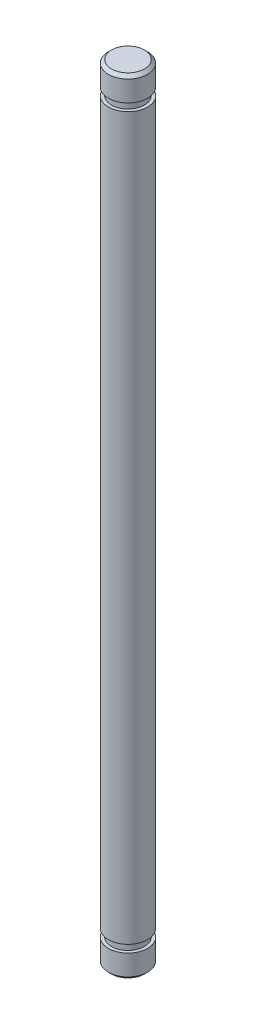
ISO-10303-21;
HEADER;
FILE_DESCRIPTION(('STEP AP214'),'2;1');
FILE_NAME('part.step','',(''),(''),'','','');
FILE_SCHEMA(('AUTOMOTIVE_DESIGN { 1 0 10303 214 1 1 1 1 }'));
ENDSEC;
DATA;
#1=APPLICATION_CONTEXT('core data for automotive mechanical design processes');
#2=APPLICATION_PROTOCOL_DEFINITION('international standard','automotive_design',2000,#1);
#3=PRODUCT_CONTEXT('',#1,'mechanical');
#4=PRODUCT('Part','Part','',(#3));
#5=PRODUCT_RELATED_PRODUCT_CATEGORY('part','',(#4));
#6=PRODUCT_DEFINITION_FORMATION('','',#4);
#7=PRODUCT_DEFINITION_CONTEXT('part definition',#1,'design');
#8=PRODUCT_DEFINITION('design','',#6,#7);
#9=PRODUCT_DEFINITION_SHAPE('','',#8);
#10=(LENGTH_UNIT() NAMED_UNIT(*) SI_UNIT(.MILLI.,.METRE.));
#11=(NAMED_UNIT(*) PLANE_ANGLE_UNIT() SI_UNIT($,.RADIAN.));
#12=(NAMED_UNIT(*) SI_UNIT($,.STERADIAN.) SOLID_ANGLE_UNIT());
#13=UNCERTAINTY_MEASURE_WITH_UNIT(LENGTH_MEASURE(1.E-05),#10,'distance_accuracy_value','');
#14=(GEOMETRIC_REPRESENTATION_CONTEXT(3) GLOBAL_UNCERTAINTY_ASSIGNED_CONTEXT((#13)) GLOBAL_UNIT_ASSIGNED_CONTEXT((#10,
#11,#12)) REPRESENTATION_CONTEXT('',''));
#15=CARTESIAN_POINT('',(0.,0.,0.));
#16=DIRECTION('',(0.,0.,1.));
#17=DIRECTION('',(1.,0.,0.));
#18=AXIS2_PLACEMENT_3D('',#15,#16,#17);
#19=CARTESIAN_POINT('',(0.,15.875,0.));
#20=DIRECTION('',(0.,-1.,0.));
#21=DIRECTION('',(0.,0.,-1.));
#22=AXIS2_PLACEMENT_3D('',#19,#20,#21);
#23=CYLINDRICAL_SURFACE('',#22,0.79375);
#24=CARTESIAN_POINT('',(0.,14.605,0.));
#25=DIRECTION('',(0.,1.,0.));
#26=DIRECTION('',(0.,0.,1.));
#27=AXIS2_PLACEMENT_3D('',#24,#25,#26);
#28=CIRCLE('',#27,0.79375);
#29=CARTESIAN_POINT('',(0.,14.605,0.79375));
#30=VERTEX_POINT('',#29);
#31=EDGE_CURVE('E399',#30,#30,#28,.T.);
#32=ORIENTED_EDGE('',*,*,#31,.F.);
#33=EDGE_LOOP('',(#32));
#34=FACE_BOUND('',#33,.T.);
#35=CARTESIAN_POINT('',(0.,-14.605,0.));
#36=DIRECTION('',(0.,1.,0.));
#37=DIRECTION('',(0.,0.,1.));
#38=AXIS2_PLACEMENT_3D('',#35,#36,#37);
#39=CIRCLE('',#38,0.79375);
#40=CARTESIAN_POINT('',(0.,-14.605,0.79375));
#41=VERTEX_POINT('',#40);
#42=EDGE_CURVE('E402',#41,#41,#39,.T.);
#43=ORIENTED_EDGE('',*,*,#42,.T.);
#44=EDGE_LOOP('',(#43));
#45=FACE_BOUND('',#44,.T.);
#46=ADVANCED_FACE('F370',(#34,#45),#23,.T.);
#47=CARTESIAN_POINT('',(0.,15.748,0.));
#48=DIRECTION('',(0.,1.,0.));
#49=DIRECTION('',(0.,0.,1.));
#50=AXIS2_PLACEMENT_3D('',#47,#48,#49);
#51=CIRCLE('',#50,0.79375);
#52=CARTESIAN_POINT('',(0.,15.748,0.79375));
#53=VERTEX_POINT('',#52);
#54=EDGE_CURVE('E10',#53,#53,#51,.F.);
#55=ORIENTED_EDGE('',*,*,#54,.T.);
#56=EDGE_LOOP('',(#55));
#57=FACE_BOUND('',#56,.T.);
#58=CARTESIAN_POINT('',(0.,14.9098,0.));
#59=DIRECTION('',(0.,1.,0.));
#60=DIRECTION('',(0.,0.,1.));
#61=AXIS2_PLACEMENT_3D('',#58,#59,#60);
#62=CIRCLE('',#61,0.79375);
#63=CARTESIAN_POINT('',(0.,14.9098,0.79375));
#64=VERTEX_POINT('',#63);
#65=EDGE_CURVE('E390',#64,#64,#62,.T.);
#66=ORIENTED_EDGE('',*,*,#65,.T.);
#67=EDGE_LOOP('',(#66));
#68=FACE_BOUND('',#67,.T.);
#69=ADVANCED_FACE('F372',(#57,#68),#23,.T.);
#70=CARTESIAN_POINT('',(0.,15.875,0.));
#71=DIRECTION('',(0.,1.,0.));
#72=DIRECTION('',(0.,0.,1.));
#73=AXIS2_PLACEMENT_3D('',#70,#71,#72);
#74=PLANE('',#73);
#75=CARTESIAN_POINT('',(0.,15.875,0.));
#76=DIRECTION('',(0.,1.,0.));
#77=DIRECTION('',(0.,0.,1.));
#78=AXIS2_PLACEMENT_3D('',#75,#76,#77);
#79=CIRCLE('',#78,0.666750000000002);
#80=CARTESIAN_POINT('',(0.,15.875,0.666750000000002));
#81=VERTEX_POINT('',#80);
#82=EDGE_CURVE('E377',#81,#81,#79,.T.);
#83=ORIENTED_EDGE('',*,*,#82,.T.);
#84=EDGE_LOOP('',(#83));
#85=FACE_BOUND('',#84,.T.);
#86=ADVANCED_FACE('F433',(#85),#74,.T.);
#87=CARTESIAN_POINT('',(0.,14.9098,-0.79375));
#88=DIRECTION('',(0.,-1.,0.));
#89=DIRECTION('',(0.,0.,-1.));
#90=AXIS2_PLACEMENT_3D('',#87,#88,#89);
#91=PLANE('',#90);
#92=CARTESIAN_POINT('',(0.,14.9098,0.));
#93=DIRECTION('',(0.,1.,0.));
#94=DIRECTION('',(0.,0.,1.));
#95=AXIS2_PLACEMENT_3D('',#92,#93,#94);
#96=CIRCLE('',#95,0.666750000000001);
#97=CARTESIAN_POINT('',(0.,14.9098,0.666750000000001));
#98=VERTEX_POINT('',#97);
#99=EDGE_CURVE('E393',#98,#98,#96,.T.);
#100=ORIENTED_EDGE('',*,*,#99,.T.);
#101=EDGE_LOOP('',(#100));
#102=FACE_BOUND('',#101,.T.);
#103=ORIENTED_EDGE('',*,*,#65,.F.);
#104=EDGE_LOOP('',(#103));
#105=FACE_BOUND('',#104,.T.);
#106=ADVANCED_FACE('F462',(#102,#105),#91,.T.);
#107=CARTESIAN_POINT('',(0.,15.875,0.));
#108=DIRECTION('',(0.,1.,0.));
#109=DIRECTION('',(0.,0.,1.));
#110=AXIS2_PLACEMENT_3D('',#107,#108,#109);
#111=CYLINDRICAL_SURFACE('',#110,0.666750000000001);
#112=CARTESIAN_POINT('',(0.,14.605,0.));
#113=DIRECTION('',(0.,1.,0.));
#114=DIRECTION('',(0.,0.,1.));
#115=AXIS2_PLACEMENT_3D('',#112,#113,#114);
#116=CIRCLE('',#115,0.666750000000001);
#117=CARTESIAN_POINT('',(0.,14.605,0.666750000000001));
#118=VERTEX_POINT('',#117);
#119=EDGE_CURVE('E396',#118,#118,#116,.T.);
#120=ORIENTED_EDGE('',*,*,#119,.T.);
#121=EDGE_LOOP('',(#120));
#122=FACE_BOUND('',#121,.T.);
#123=ORIENTED_EDGE('',*,*,#99,.F.);
#124=EDGE_LOOP('',(#123));
#125=FACE_BOUND('',#124,.T.);
#126=ADVANCED_FACE('F455',(#122,#125),#111,.T.);
#127=CARTESIAN_POINT('',(0.,14.605,-0.79375));
#128=DIRECTION('',(0.,1.,0.));
#129=DIRECTION('',(0.,0.,1.));
#130=AXIS2_PLACEMENT_3D('',#127,#128,#129);
#131=PLANE('',#130);
#132=ORIENTED_EDGE('',*,*,#31,.T.);
#133=EDGE_LOOP('',(#132));
#134=FACE_BOUND('',#133,.T.);
#135=ORIENTED_EDGE('',*,*,#119,.F.);
#136=EDGE_LOOP('',(#135));
#137=FACE_BOUND('',#136,.T.);
#138=ADVANCED_FACE('F446',(#134,#137),#131,.T.);
#139=CARTESIAN_POINT('',(0.,-14.605,-0.79375));
#140=DIRECTION('',(0.,-1.,0.));
#141=DIRECTION('',(0.,0.,-1.));
#142=AXIS2_PLACEMENT_3D('',#139,#140,#141);
#143=PLANE('',#142);
#144=CARTESIAN_POINT('',(0.,-14.605,0.));
#145=DIRECTION('',(0.,1.,0.));
#146=DIRECTION('',(0.,0.,1.));
#147=AXIS2_PLACEMENT_3D('',#144,#145,#146);
#148=CIRCLE('',#147,0.666750000000001);
#149=CARTESIAN_POINT('',(0.,-14.605,0.666750000000001));
#150=VERTEX_POINT('',#149);
#151=EDGE_CURVE('E405',#150,#150,#148,.T.);
#152=ORIENTED_EDGE('',*,*,#151,.T.);
#153=EDGE_LOOP('',(#152));
#154=FACE_BOUND('',#153,.T.);
#155=ORIENTED_EDGE('',*,*,#42,.F.);
#156=EDGE_LOOP('',(#155));
#157=FACE_BOUND('',#156,.T.);
#158=ADVANCED_FACE('F443',(#154,#157),#143,.T.);
#159=CARTESIAN_POINT('',(0.,15.875,0.));
#160=DIRECTION('',(0.,1.,0.));
#161=DIRECTION('',(0.,0.,1.));
#162=AXIS2_PLACEMENT_3D('',#159,#160,#161);
#163=CYLINDRICAL_SURFACE('',#162,0.666750000000001);
#164=CARTESIAN_POINT('',(0.,-14.9098,0.));
#165=DIRECTION('',(0.,1.,0.));
#166=DIRECTION('',(0.,0.,1.));
#167=AXIS2_PLACEMENT_3D('',#164,#165,#166);
#168=CIRCLE('',#167,0.666750000000001);
#169=CARTESIAN_POINT('',(0.,-14.9098,0.666750000000001));
#170=VERTEX_POINT('',#169);
#171=EDGE_CURVE('E408',#170,#170,#168,.T.);
#172=ORIENTED_EDGE('',*,*,#171,.T.);
#173=EDGE_LOOP('',(#172));
#174=FACE_BOUND('',#173,.T.);
#175=ORIENTED_EDGE('',*,*,#151,.F.);
#176=EDGE_LOOP('',(#175));
#177=FACE_BOUND('',#176,.T.);
#178=ADVANCED_FACE('F445',(#174,#177),#163,.T.);
#179=CARTESIAN_POINT('',(0.,-14.9098,-0.79375));
#180=DIRECTION('',(0.,1.,0.));
#181=DIRECTION('',(0.,0.,1.));
#182=AXIS2_PLACEMENT_3D('',#179,#180,#181);
#183=PLANE('',#182);
#184=CARTESIAN_POINT('',(0.,-14.9098,0.));
#185=DIRECTION('',(0.,1.,0.));
#186=DIRECTION('',(0.,0.,1.));
#187=AXIS2_PLACEMENT_3D('',#184,#185,#186);
#188=CIRCLE('',#187,0.79375);
#189=CARTESIAN_POINT('',(0.,-14.9098,0.79375));
#190=VERTEX_POINT('',#189);
#191=EDGE_CURVE('E411',#190,#190,#188,.T.);
#192=ORIENTED_EDGE('',*,*,#191,.T.);
#193=EDGE_LOOP('',(#192));
#194=FACE_BOUND('',#193,.T.);
#195=ORIENTED_EDGE('',*,*,#171,.F.);
#196=EDGE_LOOP('',(#195));
#197=FACE_BOUND('',#196,.T.);
#198=ADVANCED_FACE('F415',(#194,#197),#183,.T.);
#199=CARTESIAN_POINT('',(0.,-15.875,0.));
#200=DIRECTION('',(0.,1.,0.));
#201=DIRECTION('',(0.,0.,1.));
#202=AXIS2_PLACEMENT_3D('',#199,#200,#201);
#203=PLANE('',#202);
#204=CARTESIAN_POINT('',(0.,-15.875,0.));
#205=DIRECTION('',(0.,1.,0.));
#206=DIRECTION('',(0.,0.,1.));
#207=AXIS2_PLACEMENT_3D('',#204,#205,#206);
#208=CIRCLE('',#207,0.666750000000002);
#209=CARTESIAN_POINT('',(0.,-15.875,0.666750000000002));
#210=VERTEX_POINT('',#209);
#211=EDGE_CURVE('E381',#210,#210,#208,.F.);
#212=ORIENTED_EDGE('',*,*,#211,.T.);
#213=EDGE_LOOP('',(#212));
#214=FACE_BOUND('',#213,.T.);
#215=ADVANCED_FACE('F421',(#214),#203,.F.);
#216=CARTESIAN_POINT('',(0.,-15.748,0.));
#217=DIRECTION('',(0.,1.,0.));
#218=DIRECTION('',(0.,0.,1.));
#219=AXIS2_PLACEMENT_3D('',#216,#217,#218);
#220=CIRCLE('',#219,0.79375);
#221=CARTESIAN_POINT('',(0.,-15.748,0.79375));
#222=VERTEX_POINT('',#221);
#223=EDGE_CURVE('E385',#222,#222,#220,.T.);
#224=ORIENTED_EDGE('',*,*,#223,.T.);
#225=EDGE_LOOP('',(#224));
#226=FACE_BOUND('',#225,.T.);
#227=ORIENTED_EDGE('',*,*,#191,.F.);
#228=EDGE_LOOP('',(#227));
#229=FACE_BOUND('',#228,.T.);
#230=ADVANCED_FACE('F418',(#226,#229),#23,.T.);
#231=CARTESIAN_POINT('',(0.,-15.748,0.));
#232=DIRECTION('',(0.,1.,0.));
#233=DIRECTION('',(0.,0.,1.));
#234=AXIS2_PLACEMENT_3D('',#231,#232,#233);
#235=CONICAL_SURFACE('',#234,0.79375,0.785398163397434);
#236=ORIENTED_EDGE('',*,*,#211,.F.);
#237=EDGE_LOOP('',(#236));
#238=FACE_BOUND('',#237,.T.);
#239=ORIENTED_EDGE('',*,*,#223,.F.);
#240=EDGE_LOOP('',(#239));
#241=FACE_BOUND('',#240,.T.);
#242=ADVANCED_FACE('F420',(#238,#241),#235,.T.);
#243=CARTESIAN_POINT('',(0.,15.875,0.));
#244=DIRECTION('',(0.,-1.,0.));
#245=DIRECTION('',(0.,0.,-1.));
#246=AXIS2_PLACEMENT_3D('',#243,#244,#245);
#247=CONICAL_SURFACE('',#246,0.666750000000002,0.785398163397448);
#248=ORIENTED_EDGE('',*,*,#54,.F.);
#249=EDGE_LOOP('',(#248));
#250=FACE_BOUND('',#249,.T.);
#251=ORIENTED_EDGE('',*,*,#82,.F.);
#252=EDGE_LOOP('',(#251));
#253=FACE_BOUND('',#252,.T.);
#254=ADVANCED_FACE('F427',(#250,#253),#247,.T.);
#255=CLOSED_SHELL('',(#46,#69,#86,#106,#126,#138,#158,#178,#198,#215,#230,#242,#254));
#256=MANIFOLD_SOLID_BREP('B2',#255);
#257=ADVANCED_BREP_SHAPE_REPRESENTATION('',(#18,#256),#14);
#258=SHAPE_DEFINITION_REPRESENTATION(#9,#257);
ENDSEC;
END-ISO-10303-21;
